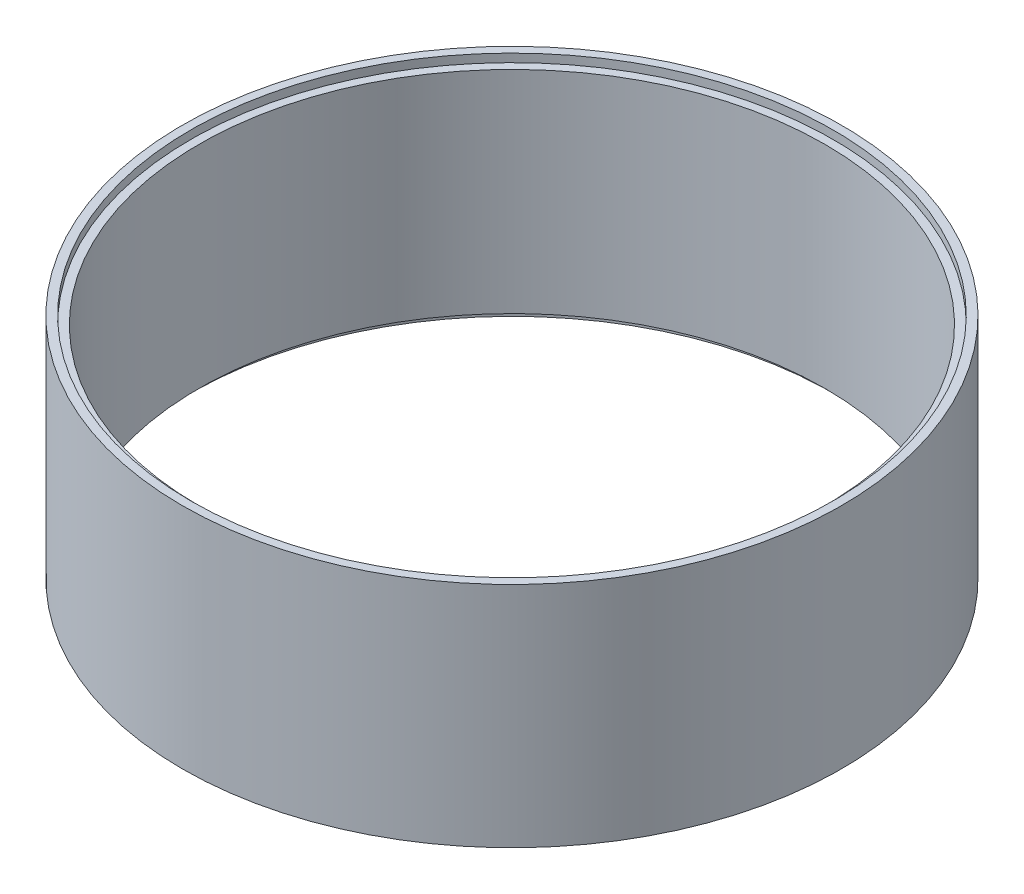
ISO-10303-21;
HEADER;
FILE_DESCRIPTION(('STEP AP214'),'2;1');
FILE_NAME('part.step','',(''),(''),'','','');
FILE_SCHEMA(('AUTOMOTIVE_DESIGN { 1 0 10303 214 1 1 1 1 }'));
ENDSEC;
DATA;
#1=APPLICATION_CONTEXT('core data for automotive mechanical design processes');
#2=APPLICATION_PROTOCOL_DEFINITION('international standard','automotive_design',2000,#1);
#3=PRODUCT_CONTEXT('',#1,'mechanical');
#4=PRODUCT('Part','Part','',(#3));
#5=PRODUCT_RELATED_PRODUCT_CATEGORY('part','',(#4));
#6=PRODUCT_DEFINITION_FORMATION('','',#4);
#7=PRODUCT_DEFINITION_CONTEXT('part definition',#1,'design');
#8=PRODUCT_DEFINITION('design','',#6,#7);
#9=PRODUCT_DEFINITION_SHAPE('','',#8);
#10=(LENGTH_UNIT() NAMED_UNIT(*) SI_UNIT(.MILLI.,.METRE.));
#11=(NAMED_UNIT(*) PLANE_ANGLE_UNIT() SI_UNIT($,.RADIAN.));
#12=(NAMED_UNIT(*) SI_UNIT($,.STERADIAN.) SOLID_ANGLE_UNIT());
#13=UNCERTAINTY_MEASURE_WITH_UNIT(LENGTH_MEASURE(1.E-05),#10,'distance_accuracy_value','');
#14=(GEOMETRIC_REPRESENTATION_CONTEXT(3) GLOBAL_UNCERTAINTY_ASSIGNED_CONTEXT((#13)) GLOBAL_UNIT_ASSIGNED_CONTEXT((#10,
#11,#12)) REPRESENTATION_CONTEXT('',''));
#15=CARTESIAN_POINT('',(0.,0.,0.));
#16=DIRECTION('',(0.,0.,1.));
#17=DIRECTION('',(1.,0.,0.));
#18=AXIS2_PLACEMENT_3D('',#15,#16,#17);
#19=CARTESIAN_POINT('',(0.,55.,0.));
#20=DIRECTION('',(0.,-1.,0.));
#21=DIRECTION('',(0.,0.,-1.));
#22=AXIS2_PLACEMENT_3D('',#19,#20,#21);
#23=CYLINDRICAL_SURFACE('',#22,151.);
#24=CARTESIAN_POINT('',(0.,51.,0.));
#25=DIRECTION('',(0.,1.,0.));
#26=DIRECTION('',(0.,0.,1.));
#27=AXIS2_PLACEMENT_3D('',#24,#25,#26);
#28=CIRCLE('',#27,151.);
#29=CARTESIAN_POINT('',(0.,51.,151.));
#30=VERTEX_POINT('',#29);
#31=EDGE_CURVE('E44',#30,#30,#28,.T.);
#32=ORIENTED_EDGE('',*,*,#31,.T.);
#33=EDGE_LOOP('',(#32));
#34=FACE_BOUND('',#33,.T.);
#35=CARTESIAN_POINT('',(0.,-51.,0.));
#36=DIRECTION('',(0.,-1.,0.));
#37=DIRECTION('',(0.,0.,-1.));
#38=AXIS2_PLACEMENT_3D('',#35,#36,#37);
#39=CIRCLE('',#38,151.);
#40=CARTESIAN_POINT('',(0.,-51.,-151.));
#41=VERTEX_POINT('',#40);
#42=EDGE_CURVE('E35',#41,#41,#39,.T.);
#43=ORIENTED_EDGE('',*,*,#42,.T.);
#44=EDGE_LOOP('',(#43));
#45=FACE_BOUND('',#44,.T.);
#46=ADVANCED_FACE('F31',(#34,#45),#23,.F.);
#47=CARTESIAN_POINT('',(0.,55.,0.));
#48=DIRECTION('',(0.,1.,0.));
#49=DIRECTION('',(0.,0.,1.));
#50=AXIS2_PLACEMENT_3D('',#47,#48,#49);
#51=PLANE('',#50);
#52=CARTESIAN_POINT('',(0.,55.,0.));
#53=DIRECTION('',(0.,1.,0.));
#54=DIRECTION('',(0.,0.,1.));
#55=AXIS2_PLACEMENT_3D('',#52,#53,#54);
#56=CIRCLE('',#55,155.);
#57=CARTESIAN_POINT('',(0.,55.,155.));
#58=VERTEX_POINT('',#57);
#59=EDGE_CURVE('E47',#58,#58,#56,.T.);
#60=ORIENTED_EDGE('',*,*,#59,.F.);
#61=EDGE_LOOP('',(#60));
#62=FACE_BOUND('',#61,.T.);
#63=CARTESIAN_POINT('',(0.,55.,0.));
#64=DIRECTION('',(0.,1.,0.));
#65=DIRECTION('',(0.,0.,1.));
#66=AXIS2_PLACEMENT_3D('',#63,#64,#65);
#67=CIRCLE('',#66,159.);
#68=CARTESIAN_POINT('',(0.,55.,159.));
#69=VERTEX_POINT('',#68);
#70=EDGE_CURVE('E10',#69,#69,#67,.T.);
#71=ORIENTED_EDGE('',*,*,#70,.T.);
#72=EDGE_LOOP('',(#71));
#73=FACE_BOUND('',#72,.T.);
#74=ADVANCED_FACE('F80',(#62,#73),#51,.T.);
#75=CARTESIAN_POINT('',(0.,-55.,0.));
#76=DIRECTION('',(0.,1.,0.));
#77=DIRECTION('',(0.,0.,1.));
#78=AXIS2_PLACEMENT_3D('',#75,#76,#77);
#79=PLANE('',#78);
#80=CARTESIAN_POINT('',(0.,-55.,0.));
#81=DIRECTION('',(0.,1.,0.));
#82=DIRECTION('',(0.,0.,1.));
#83=AXIS2_PLACEMENT_3D('',#80,#81,#82);
#84=CIRCLE('',#83,155.);
#85=CARTESIAN_POINT('',(0.,-55.,155.));
#86=VERTEX_POINT('',#85);
#87=EDGE_CURVE('E58',#86,#86,#84,.T.);
#88=ORIENTED_EDGE('',*,*,#87,.T.);
#89=EDGE_LOOP('',(#88));
#90=FACE_BOUND('',#89,.T.);
#91=CARTESIAN_POINT('',(0.,-55.,0.));
#92=DIRECTION('',(0.,1.,0.));
#93=DIRECTION('',(0.,0.,1.));
#94=AXIS2_PLACEMENT_3D('',#91,#92,#93);
#95=CIRCLE('',#94,159.);
#96=CARTESIAN_POINT('',(0.,-55.,159.));
#97=VERTEX_POINT('',#96);
#98=EDGE_CURVE('E39',#97,#97,#95,.T.);
#99=ORIENTED_EDGE('',*,*,#98,.F.);
#100=EDGE_LOOP('',(#99));
#101=FACE_BOUND('',#100,.T.);
#102=ADVANCED_FACE('F85',(#90,#101),#79,.F.);
#103=CARTESIAN_POINT('',(0.,55.,0.));
#104=DIRECTION('',(0.,-1.,0.));
#105=DIRECTION('',(0.,0.,-1.));
#106=AXIS2_PLACEMENT_3D('',#103,#104,#105);
#107=CYLINDRICAL_SURFACE('',#106,159.);
#108=ORIENTED_EDGE('',*,*,#70,.F.);
#109=EDGE_LOOP('',(#108));
#110=FACE_BOUND('',#109,.T.);
#111=ORIENTED_EDGE('',*,*,#98,.T.);
#112=EDGE_LOOP('',(#111));
#113=FACE_BOUND('',#112,.T.);
#114=ADVANCED_FACE('F33',(#110,#113),#107,.T.);
#115=CARTESIAN_POINT('',(0.,51.,0.));
#116=DIRECTION('',(0.,1.,0.));
#117=DIRECTION('',(0.,0.,1.));
#118=AXIS2_PLACEMENT_3D('',#115,#116,#117);
#119=CYLINDRICAL_SURFACE('',#118,155.);
#120=CARTESIAN_POINT('',(0.,51.,0.));
#121=DIRECTION('',(0.,1.,0.));
#122=DIRECTION('',(0.,0.,1.));
#123=AXIS2_PLACEMENT_3D('',#120,#121,#122);
#124=CIRCLE('',#123,155.);
#125=CARTESIAN_POINT('',(0.,51.,155.));
#126=VERTEX_POINT('',#125);
#127=EDGE_CURVE('E50',#126,#126,#124,.T.);
#128=ORIENTED_EDGE('',*,*,#127,.F.);
#129=EDGE_LOOP('',(#128));
#130=FACE_BOUND('',#129,.T.);
#131=ORIENTED_EDGE('',*,*,#59,.T.);
#132=EDGE_LOOP('',(#131));
#133=FACE_BOUND('',#132,.T.);
#134=ADVANCED_FACE('F89',(#130,#133),#119,.F.);
#135=CARTESIAN_POINT('',(0.,51.,0.));
#136=DIRECTION('',(0.,1.,0.));
#137=DIRECTION('',(0.,0.,1.));
#138=AXIS2_PLACEMENT_3D('',#135,#136,#137);
#139=PLANE('',#138);
#140=ORIENTED_EDGE('',*,*,#31,.F.);
#141=EDGE_LOOP('',(#140));
#142=FACE_BOUND('',#141,.T.);
#143=ORIENTED_EDGE('',*,*,#127,.T.);
#144=EDGE_LOOP('',(#143));
#145=FACE_BOUND('',#144,.T.);
#146=ADVANCED_FACE('F77',(#142,#145),#139,.T.);
#147=CARTESIAN_POINT('',(0.,-51.,0.));
#148=DIRECTION('',(0.,-1.,0.));
#149=DIRECTION('',(0.,0.,-1.));
#150=AXIS2_PLACEMENT_3D('',#147,#148,#149);
#151=CYLINDRICAL_SURFACE('',#150,155.);
#152=CARTESIAN_POINT('',(0.,-51.,0.));
#153=DIRECTION('',(0.,1.,0.));
#154=DIRECTION('',(0.,0.,1.));
#155=AXIS2_PLACEMENT_3D('',#152,#153,#154);
#156=CIRCLE('',#155,155.);
#157=CARTESIAN_POINT('',(0.,-51.,155.));
#158=VERTEX_POINT('',#157);
#159=EDGE_CURVE('E61',#158,#158,#156,.T.);
#160=ORIENTED_EDGE('',*,*,#159,.T.);
#161=EDGE_LOOP('',(#160));
#162=FACE_BOUND('',#161,.T.);
#163=ORIENTED_EDGE('',*,*,#87,.F.);
#164=EDGE_LOOP('',(#163));
#165=FACE_BOUND('',#164,.T.);
#166=ADVANCED_FACE('F72',(#162,#165),#151,.F.);
#167=CARTESIAN_POINT('',(0.,-51.,0.));
#168=DIRECTION('',(0.,-1.,0.));
#169=DIRECTION('',(0.,0.,1.));
#170=AXIS2_PLACEMENT_3D('',#167,#168,#169);
#171=PLANE('',#170);
#172=ORIENTED_EDGE('',*,*,#42,.F.);
#173=EDGE_LOOP('',(#172));
#174=FACE_BOUND('',#173,.T.);
#175=ORIENTED_EDGE('',*,*,#159,.F.);
#176=EDGE_LOOP('',(#175));
#177=FACE_BOUND('',#176,.T.);
#178=ADVANCED_FACE('F69',(#174,#177),#171,.T.);
#179=CLOSED_SHELL('',(#46,#74,#102,#114,#134,#146,#166,#178));
#180=MANIFOLD_SOLID_BREP('B2',#179);
#181=ADVANCED_BREP_SHAPE_REPRESENTATION('',(#18,#180),#14);
#182=SHAPE_DEFINITION_REPRESENTATION(#9,#181);
ENDSEC;
END-ISO-10303-21;
